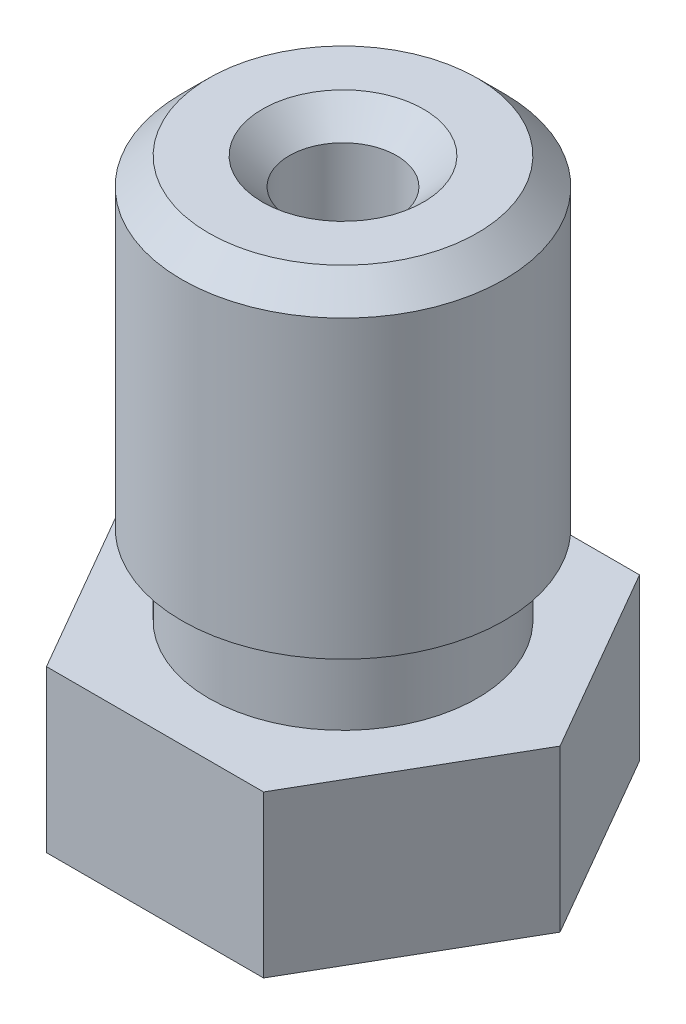
ISO-10303-21;
HEADER;
FILE_DESCRIPTION(('STEP AP214'),'2;1');
FILE_NAME('part.step','',(''),(''),'','','');
FILE_SCHEMA(('AUTOMOTIVE_DESIGN { 1 0 10303 214 1 1 1 1 }'));
ENDSEC;
DATA;
#1=APPLICATION_CONTEXT('core data for automotive mechanical design processes');
#2=APPLICATION_PROTOCOL_DEFINITION('international standard','automotive_design',2000,#1);
#3=PRODUCT_CONTEXT('',#1,'mechanical');
#4=PRODUCT('Part','Part','',(#3));
#5=PRODUCT_RELATED_PRODUCT_CATEGORY('part','',(#4));
#6=PRODUCT_DEFINITION_FORMATION('','',#4);
#7=PRODUCT_DEFINITION_CONTEXT('part definition',#1,'design');
#8=PRODUCT_DEFINITION('design','',#6,#7);
#9=PRODUCT_DEFINITION_SHAPE('','',#8);
#10=(LENGTH_UNIT() NAMED_UNIT(*) SI_UNIT(.MILLI.,.METRE.));
#11=(NAMED_UNIT(*) PLANE_ANGLE_UNIT() SI_UNIT($,.RADIAN.));
#12=(NAMED_UNIT(*) SI_UNIT($,.STERADIAN.) SOLID_ANGLE_UNIT());
#13=UNCERTAINTY_MEASURE_WITH_UNIT(LENGTH_MEASURE(1.E-05),#10,'distance_accuracy_value','');
#14=(GEOMETRIC_REPRESENTATION_CONTEXT(3) GLOBAL_UNCERTAINTY_ASSIGNED_CONTEXT((#13)) GLOBAL_UNIT_ASSIGNED_CONTEXT((#10,
#11,#12)) REPRESENTATION_CONTEXT('',''));
#15=CARTESIAN_POINT('',(0.,0.,0.));
#16=DIRECTION('',(0.,0.,1.));
#17=DIRECTION('',(1.,0.,0.));
#18=AXIS2_PLACEMENT_3D('',#15,#16,#17);
#19=CARTESIAN_POINT('',(0.,3.,0.));
#20=DIRECTION('',(0.,1.,0.));
#21=DIRECTION('',(0.,0.,1.));
#22=AXIS2_PLACEMENT_3D('',#19,#20,#21);
#23=CYLINDRICAL_SURFACE('',#22,0.2);
#24=CARTESIAN_POINT('',(0.,-2.,0.));
#25=DIRECTION('',(0.,1.,0.));
#26=DIRECTION('',(0.,0.,1.));
#27=AXIS2_PLACEMENT_3D('',#24,#25,#26);
#28=CIRCLE('',#27,0.2);
#29=CARTESIAN_POINT('',(0.,-2.,0.2));
#30=VERTEX_POINT('',#29);
#31=EDGE_CURVE('E19',#30,#30,#28,.F.);
#32=ORIENTED_EDGE('',*,*,#31,.T.);
#33=EDGE_LOOP('',(#32));
#34=FACE_BOUND('',#33,.T.);
#35=CARTESIAN_POINT('',(0.,-1.20000000003984,0.));
#36=DIRECTION('',(0.,1.,0.));
#37=DIRECTION('',(0.,0.,1.));
#38=AXIS2_PLACEMENT_3D('',#35,#36,#37);
#39=CIRCLE('',#38,0.200000000006639);
#40=CARTESIAN_POINT('',(0.,-1.20000000003984,0.200000000006639));
#41=VERTEX_POINT('',#40);
#42=EDGE_CURVE('E107',#41,#41,#39,.T.);
#43=ORIENTED_EDGE('',*,*,#42,.T.);
#44=EDGE_LOOP('',(#43));
#45=FACE_BOUND('',#44,.T.);
#46=ADVANCED_FACE('F16',(#34,#45),#23,.F.);
#47=CARTESIAN_POINT('',(0.2,-2.,0.));
#48=DIRECTION('',(0.,1.,0.));
#49=DIRECTION('',(0.,0.,1.));
#50=AXIS2_PLACEMENT_3D('',#47,#48,#49);
#51=PLANE('',#50);
#52=ORIENTED_EDGE('',*,*,#31,.F.);
#53=EDGE_LOOP('',(#52));
#54=FACE_BOUND('',#53,.T.);
#55=CARTESIAN_POINT('',(0.,-2.00000000000955,0.));
#56=DIRECTION('',(0.,1.,0.));
#57=DIRECTION('',(0.,0.,1.));
#58=AXIS2_PLACEMENT_3D('',#55,#56,#57);
#59=CIRCLE('',#58,0.50000000004502);
#60=CARTESIAN_POINT('',(0.,-2.00000000000955,0.50000000004502));
#61=VERTEX_POINT('',#60);
#62=EDGE_CURVE('E106',#61,#61,#59,.T.);
#63=ORIENTED_EDGE('',*,*,#62,.F.);
#64=EDGE_LOOP('',(#63));
#65=FACE_BOUND('',#64,.T.);
#66=ADVANCED_FACE('F132',(#54,#65),#51,.F.);
#67=CARTESIAN_POINT('',(0.,-0.700000000108503,0.));
#68=DIRECTION('',(0.,1.,0.));
#69=DIRECTION('',(0.,0.,1.));
#70=AXIS2_PLACEMENT_3D('',#67,#68,#69);
#71=CONICAL_SURFACE('',#70,0.749999999925421,0.832981266653855);
#72=ORIENTED_EDGE('',*,*,#42,.F.);
#73=EDGE_LOOP('',(#72));
#74=FACE_BOUND('',#73,.T.);
#75=CARTESIAN_POINT('',(0.,-0.700000000000002,0.));
#76=DIRECTION('',(0.,1.,0.));
#77=DIRECTION('',(0.,0.,1.));
#78=AXIS2_PLACEMENT_3D('',#75,#76,#77);
#79=CIRCLE('',#78,0.75);
#80=CARTESIAN_POINT('',(0.,-0.700000000000002,0.75));
#81=VERTEX_POINT('',#80);
#82=EDGE_CURVE('E103',#81,#81,#79,.T.);
#83=ORIENTED_EDGE('',*,*,#82,.T.);
#84=EDGE_LOOP('',(#83));
#85=FACE_BOUND('',#84,.T.);
#86=ADVANCED_FACE('F134',(#74,#85),#71,.F.);
#87=CARTESIAN_POINT('',(0.,-5.6843418860808E-11,0.));
#88=DIRECTION('',(0.,1.,0.));
#89=DIRECTION('',(0.,0.,1.));
#90=AXIS2_PLACEMENT_3D('',#87,#88,#89);
#91=CONICAL_SURFACE('',#90,2.49999999994088,0.785398163383238);
#92=ORIENTED_EDGE('',*,*,#62,.T.);
#93=EDGE_LOOP('',(#92));
#94=FACE_BOUND('',#93,.T.);
#95=CARTESIAN_POINT('',(0.,0.,0.));
#96=DIRECTION('',(0.,1.,0.));
#97=DIRECTION('',(0.,0.,1.));
#98=AXIS2_PLACEMENT_3D('',#95,#96,#97);
#99=CIRCLE('',#98,2.49999999999773);
#100=CARTESIAN_POINT('',(0.,0.,2.49999999999773));
#101=VERTEX_POINT('',#100);
#102=EDGE_CURVE('E102',#101,#101,#99,.F.);
#103=ORIENTED_EDGE('',*,*,#102,.T.);
#104=EDGE_LOOP('',(#103));
#105=FACE_BOUND('',#104,.T.);
#106=ADVANCED_FACE('F129',(#94,#105),#91,.T.);
#107=CARTESIAN_POINT('',(0.,3.,0.));
#108=DIRECTION('',(0.,1.,0.));
#109=DIRECTION('',(0.,0.,1.));
#110=AXIS2_PLACEMENT_3D('',#107,#108,#109);
#111=CYLINDRICAL_SURFACE('',#110,0.75);
#112=ORIENTED_EDGE('',*,*,#82,.F.);
#113=EDGE_LOOP('',(#112));
#114=FACE_BOUND('',#113,.T.);
#115=CARTESIAN_POINT('',(0.,-0.227272727272521,0.));
#116=DIRECTION('',(0.,1.,0.));
#117=DIRECTION('',(0.,0.,1.));
#118=AXIS2_PLACEMENT_3D('',#115,#116,#117);
#119=CIRCLE('',#118,0.749999999982265);
#120=CARTESIAN_POINT('',(0.,-0.227272727272521,0.749999999982265));
#121=VERTEX_POINT('',#120);
#122=EDGE_CURVE('E80',#121,#121,#119,.T.);
#123=ORIENTED_EDGE('',*,*,#122,.T.);
#124=EDGE_LOOP('',(#123));
#125=FACE_BOUND('',#124,.T.);
#126=ADVANCED_FACE('F206',(#114,#125),#111,.F.);
#127=CARTESIAN_POINT('',(0.,0.,0.));
#128=DIRECTION('',(0.,1.,0.));
#129=DIRECTION('',(0.,0.,1.));
#130=AXIS2_PLACEMENT_3D('',#127,#128,#129);
#131=PLANE('',#130);
#132=ORIENTED_EDGE('',*,*,#102,.F.);
#133=EDGE_LOOP('',(#132));
#134=FACE_BOUND('',#133,.T.);
#135=DIRECTION('',(-0.5,0.,-0.866025403784439));
#136=VECTOR('',#135,1.);
#137=CARTESIAN_POINT('',(-4.04145188432738,0.,0.));
#138=LINE('',#137,#136);
#139=CARTESIAN_POINT('',(-2.02072594216369,0.,3.5));
#140=VERTEX_POINT('',#139);
#141=CARTESIAN_POINT('',(-4.04145188432738,0.,0.));
#142=VERTEX_POINT('',#141);
#143=EDGE_CURVE('E99',#140,#142,#138,.T.);
#144=ORIENTED_EDGE('',*,*,#143,.T.);
#145=DIRECTION('',(0.5,0.,-0.866025403784439));
#146=VECTOR('',#145,1.);
#147=CARTESIAN_POINT('',(-2.02072594216369,0.,-3.5));
#148=LINE('',#147,#146);
#149=CARTESIAN_POINT('',(-2.02072594216369,0.,-3.5));
#150=VERTEX_POINT('',#149);
#151=EDGE_CURVE('E381',#142,#150,#148,.T.);
#152=ORIENTED_EDGE('',*,*,#151,.T.);
#153=DIRECTION('',(1.,0.,0.));
#154=VECTOR('',#153,1.);
#155=CARTESIAN_POINT('',(2.02072594216369,0.,-3.5));
#156=LINE('',#155,#154);
#157=CARTESIAN_POINT('',(2.02072594216369,0.,-3.5));
#158=VERTEX_POINT('',#157);
#159=EDGE_CURVE('E360',#150,#158,#156,.T.);
#160=ORIENTED_EDGE('',*,*,#159,.T.);
#161=DIRECTION('',(0.500000000000001,0.,0.866025403784438));
#162=VECTOR('',#161,1.);
#163=CARTESIAN_POINT('',(4.04145188432738,0.,0.));
#164=LINE('',#163,#162);
#165=CARTESIAN_POINT('',(4.04145188432738,0.,0.));
#166=VERTEX_POINT('',#165);
#167=EDGE_CURVE('E84',#158,#166,#164,.T.);
#168=ORIENTED_EDGE('',*,*,#167,.T.);
#169=DIRECTION('',(-0.5,0.,0.866025403784439));
#170=VECTOR('',#169,1.);
#171=CARTESIAN_POINT('',(2.02072594216369,0.,3.5));
#172=LINE('',#171,#170);
#173=CARTESIAN_POINT('',(2.02072594216369,0.,3.5));
#174=VERTEX_POINT('',#173);
#175=EDGE_CURVE('E66',#166,#174,#172,.T.);
#176=ORIENTED_EDGE('',*,*,#175,.T.);
#177=DIRECTION('',(-1.,0.,0.));
#178=VECTOR('',#177,1.);
#179=CARTESIAN_POINT('',(-2.02072594216369,0.,3.5));
#180=LINE('',#179,#178);
#181=EDGE_CURVE('E71',#174,#140,#180,.T.);
#182=ORIENTED_EDGE('',*,*,#181,.T.);
#183=EDGE_LOOP('',(#144,#152,#160,#168,#176,#182));
#184=FACE_BOUND('',#183,.T.);
#185=ADVANCED_FACE('F82',(#134,#184),#131,.F.);
#186=CARTESIAN_POINT('',(0.,-1.13686837721616E-10,0.));
#187=DIRECTION('',(0.,1.,0.));
#188=DIRECTION('',(0.,0.,1.));
#189=AXIS2_PLACEMENT_3D('',#186,#187,#188);
#190=CONICAL_SURFACE('',#189,0.999999999862666,0.832981266776287);
#191=ORIENTED_EDGE('',*,*,#122,.F.);
#192=EDGE_LOOP('',(#191));
#193=FACE_BOUND('',#192,.T.);
#194=CARTESIAN_POINT('',(0.,0.,0.));
#195=DIRECTION('',(0.,-1.,0.));
#196=DIRECTION('',(0.,0.,-1.));
#197=AXIS2_PLACEMENT_3D('',#194,#195,#196);
#198=CIRCLE('',#197,1.);
#199=CARTESIAN_POINT('',(0.,0.,-1.));
#200=VERTEX_POINT('',#199);
#201=EDGE_CURVE('E95',#200,#200,#198,.F.);
#202=ORIENTED_EDGE('',*,*,#201,.T.);
#203=EDGE_LOOP('',(#202));
#204=FACE_BOUND('',#203,.T.);
#205=ADVANCED_FACE('F200',(#193,#204),#190,.F.);
#206=CARTESIAN_POINT('',(-2.02072594216369,3.,3.5));
#207=DIRECTION('',(0.,0.,-1.));
#208=DIRECTION('',(-1.,0.,0.));
#209=AXIS2_PLACEMENT_3D('',#206,#207,#208);
#210=PLANE('',#209);
#211=DIRECTION('',(0.,1.,0.));
#212=VECTOR('',#211,1.);
#213=CARTESIAN_POINT('',(2.02072594216369,3.,3.5));
#214=LINE('',#213,#212);
#215=CARTESIAN_POINT('',(2.02072594216369,3.,3.5));
#216=VERTEX_POINT('',#215);
#217=EDGE_CURVE('E73',#174,#216,#214,.T.);
#218=ORIENTED_EDGE('',*,*,#217,.T.);
#219=DIRECTION('',(1.,0.,0.));
#220=VECTOR('',#219,1.);
#221=CARTESIAN_POINT('',(0.,3.,3.5));
#222=LINE('',#221,#220);
#223=CARTESIAN_POINT('',(-2.02072594216369,3.,3.5));
#224=VERTEX_POINT('',#223);
#225=EDGE_CURVE('E98',#224,#216,#222,.T.);
#226=ORIENTED_EDGE('',*,*,#225,.F.);
#227=DIRECTION('',(0.,1.,0.));
#228=VECTOR('',#227,1.);
#229=CARTESIAN_POINT('',(-2.02072594216369,3.,3.5));
#230=LINE('',#229,#228);
#231=EDGE_CURVE('E76',#224,#140,#230,.F.);
#232=ORIENTED_EDGE('',*,*,#231,.T.);
#233=ORIENTED_EDGE('',*,*,#181,.F.);
#234=EDGE_LOOP('',(#218,#226,#232,#233));
#235=FACE_BOUND('',#234,.T.);
#236=ADVANCED_FACE('F72',(#235),#210,.F.);
#237=CARTESIAN_POINT('',(2.02072594216369,3.,3.5));
#238=DIRECTION('',(-0.866025403784439,0.,-0.5));
#239=DIRECTION('',(-0.5,0.,0.866025403784439));
#240=AXIS2_PLACEMENT_3D('',#237,#238,#239);
#241=PLANE('',#240);
#242=DIRECTION('',(0.,1.,0.));
#243=VECTOR('',#242,1.);
#244=CARTESIAN_POINT('',(4.04145188432738,3.,0.));
#245=LINE('',#244,#243);
#246=CARTESIAN_POINT('',(4.04145188432738,3.,0.));
#247=VERTEX_POINT('',#246);
#248=EDGE_CURVE('E86',#166,#247,#245,.T.);
#249=ORIENTED_EDGE('',*,*,#248,.T.);
#250=DIRECTION('',(0.5,0.,-0.866025403784439));
#251=VECTOR('',#250,1.);
#252=CARTESIAN_POINT('',(2.02072594216369,3.,3.5));
#253=LINE('',#252,#251);
#254=EDGE_CURVE('E90',#216,#247,#253,.T.);
#255=ORIENTED_EDGE('',*,*,#254,.F.);
#256=ORIENTED_EDGE('',*,*,#217,.F.);
#257=ORIENTED_EDGE('',*,*,#175,.F.);
#258=EDGE_LOOP('',(#249,#255,#256,#257));
#259=FACE_BOUND('',#258,.T.);
#260=ADVANCED_FACE('F88',(#259),#241,.F.);
#261=CARTESIAN_POINT('',(4.04145188432738,3.,0.));
#262=DIRECTION('',(-0.866025403784438,0.,0.500000000000001));
#263=DIRECTION('',(0.500000000000001,0.,0.866025403784438));
#264=AXIS2_PLACEMENT_3D('',#261,#262,#263);
#265=PLANE('',#264);
#266=DIRECTION('',(0.,1.,0.));
#267=VECTOR('',#266,1.);
#268=CARTESIAN_POINT('',(2.02072594216369,3.,-3.5));
#269=LINE('',#268,#267);
#270=CARTESIAN_POINT('',(2.02072594216369,3.,-3.5));
#271=VERTEX_POINT('',#270);
#272=EDGE_CURVE('E356',#158,#271,#269,.T.);
#273=ORIENTED_EDGE('',*,*,#272,.T.);
#274=DIRECTION('',(-0.500000000000001,0.,-0.866025403784438));
#275=VECTOR('',#274,1.);
#276=CARTESIAN_POINT('',(4.04145188432738,3.,0.));
#277=LINE('',#276,#275);
#278=EDGE_CURVE('E359',#247,#271,#277,.T.);
#279=ORIENTED_EDGE('',*,*,#278,.F.);
#280=ORIENTED_EDGE('',*,*,#248,.F.);
#281=ORIENTED_EDGE('',*,*,#167,.F.);
#282=EDGE_LOOP('',(#273,#279,#280,#281));
#283=FACE_BOUND('',#282,.T.);
#284=ADVANCED_FACE('F191',(#283),#265,.F.);
#285=CARTESIAN_POINT('',(2.02072594216369,3.,-3.5));
#286=DIRECTION('',(0.,0.,1.));
#287=DIRECTION('',(1.,0.,0.));
#288=AXIS2_PLACEMENT_3D('',#285,#286,#287);
#289=PLANE('',#288);
#290=DIRECTION('',(0.,1.,0.));
#291=VECTOR('',#290,1.);
#292=CARTESIAN_POINT('',(-2.02072594216369,3.,-3.5));
#293=LINE('',#292,#291);
#294=CARTESIAN_POINT('',(-2.02072594216369,3.,-3.5));
#295=VERTEX_POINT('',#294);
#296=EDGE_CURVE('E365',#150,#295,#293,.T.);
#297=ORIENTED_EDGE('',*,*,#296,.T.);
#298=DIRECTION('',(1.,0.,0.));
#299=VECTOR('',#298,1.);
#300=CARTESIAN_POINT('',(0.,3.,-3.5));
#301=LINE('',#300,#299);
#302=EDGE_CURVE('E363',#271,#295,#301,.F.);
#303=ORIENTED_EDGE('',*,*,#302,.F.);
#304=ORIENTED_EDGE('',*,*,#272,.F.);
#305=ORIENTED_EDGE('',*,*,#159,.F.);
#306=EDGE_LOOP('',(#297,#303,#304,#305));
#307=FACE_BOUND('',#306,.T.);
#308=ADVANCED_FACE('F188',(#307),#289,.F.);
#309=CARTESIAN_POINT('',(-2.02072594216369,3.,-3.5));
#310=DIRECTION('',(0.866025403784439,0.,0.5));
#311=DIRECTION('',(0.5,0.,-0.866025403784439));
#312=AXIS2_PLACEMENT_3D('',#309,#310,#311);
#313=PLANE('',#312);
#314=DIRECTION('',(0.,1.,0.));
#315=VECTOR('',#314,1.);
#316=CARTESIAN_POINT('',(-4.04145188432738,3.,0.));
#317=LINE('',#316,#315);
#318=CARTESIAN_POINT('',(-4.04145188432738,3.,0.));
#319=VERTEX_POINT('',#318);
#320=EDGE_CURVE('E34',#142,#319,#317,.T.);
#321=ORIENTED_EDGE('',*,*,#320,.T.);
#322=DIRECTION('',(-0.5,0.,0.866025403784439));
#323=VECTOR('',#322,1.);
#324=CARTESIAN_POINT('',(-2.02072594216369,3.,-3.5));
#325=LINE('',#324,#323);
#326=EDGE_CURVE('E368',#295,#319,#325,.T.);
#327=ORIENTED_EDGE('',*,*,#326,.F.);
#328=ORIENTED_EDGE('',*,*,#296,.F.);
#329=ORIENTED_EDGE('',*,*,#151,.F.);
#330=EDGE_LOOP('',(#321,#327,#328,#329));
#331=FACE_BOUND('',#330,.T.);
#332=ADVANCED_FACE('F184',(#331),#313,.F.);
#333=CARTESIAN_POINT('',(-4.04145188432738,3.,0.));
#334=DIRECTION('',(0.866025403784439,0.,-0.5));
#335=DIRECTION('',(-0.5,0.,-0.866025403784439));
#336=AXIS2_PLACEMENT_3D('',#333,#334,#335);
#337=PLANE('',#336);
#338=ORIENTED_EDGE('',*,*,#231,.F.);
#339=DIRECTION('',(0.5,0.,0.866025403784438));
#340=VECTOR('',#339,1.);
#341=CARTESIAN_POINT('',(-4.04145188432738,3.,0.));
#342=LINE('',#341,#340);
#343=EDGE_CURVE('E377',#319,#224,#342,.T.);
#344=ORIENTED_EDGE('',*,*,#343,.F.);
#345=ORIENTED_EDGE('',*,*,#320,.F.);
#346=ORIENTED_EDGE('',*,*,#143,.F.);
#347=EDGE_LOOP('',(#338,#344,#345,#346));
#348=FACE_BOUND('',#347,.T.);
#349=ADVANCED_FACE('F180',(#348),#337,.F.);
#350=CARTESIAN_POINT('',(0.,3.,0.));
#351=DIRECTION('',(0.,-1.,0.));
#352=DIRECTION('',(0.,0.,-1.));
#353=AXIS2_PLACEMENT_3D('',#350,#351,#352);
#354=CYLINDRICAL_SURFACE('',#353,1.);
#355=CARTESIAN_POINT('',(0.,9.99999999993406,0.));
#356=DIRECTION('',(0.,1.,0.));
#357=DIRECTION('',(0.,0.,1.));
#358=AXIS2_PLACEMENT_3D('',#355,#356,#357);
#359=CIRCLE('',#358,1.0000000000332);
#360=CARTESIAN_POINT('',(0.,9.99999999993406,1.0000000000332));
#361=VERTEX_POINT('',#360);
#362=EDGE_CURVE('E124',#361,#361,#359,.T.);
#363=ORIENTED_EDGE('',*,*,#362,.T.);
#364=EDGE_LOOP('',(#363));
#365=FACE_BOUND('',#364,.T.);
#366=ORIENTED_EDGE('',*,*,#201,.F.);
#367=EDGE_LOOP('',(#366));
#368=FACE_BOUND('',#367,.T.);
#369=ADVANCED_FACE('F176',(#365,#368),#354,.F.);
#370=CARTESIAN_POINT('',(0.,3.,0.));
#371=DIRECTION('',(0.,1.,0.));
#372=DIRECTION('',(0.,0.,1.));
#373=AXIS2_PLACEMENT_3D('',#370,#371,#372);
#374=PLANE('',#373);
#375=CARTESIAN_POINT('',(0.,3.,0.));
#376=DIRECTION('',(0.,1.,0.));
#377=DIRECTION('',(0.,0.,1.));
#378=AXIS2_PLACEMENT_3D('',#375,#376,#377);
#379=CIRCLE('',#378,2.5);
#380=CARTESIAN_POINT('',(0.,3.,2.5));
#381=VERTEX_POINT('',#380);
#382=EDGE_CURVE('E121',#381,#381,#379,.T.);
#383=ORIENTED_EDGE('',*,*,#382,.F.);
#384=EDGE_LOOP('',(#383));
#385=FACE_BOUND('',#384,.T.);
#386=ORIENTED_EDGE('',*,*,#326,.T.);
#387=ORIENTED_EDGE('',*,*,#343,.T.);
#388=ORIENTED_EDGE('',*,*,#225,.T.);
#389=ORIENTED_EDGE('',*,*,#254,.T.);
#390=ORIENTED_EDGE('',*,*,#278,.T.);
#391=ORIENTED_EDGE('',*,*,#302,.T.);
#392=EDGE_LOOP('',(#386,#387,#388,#389,#390,#391));
#393=FACE_BOUND('',#392,.T.);
#394=ADVANCED_FACE('F172',(#385,#393),#374,.T.);
#395=CARTESIAN_POINT('',(0.,10.4999999998086,0.));
#396=DIRECTION('',(0.,1.,0.));
#397=DIRECTION('',(0.,0.,1.));
#398=AXIS2_PLACEMENT_3D('',#395,#396,#397);
#399=CONICAL_SURFACE('',#398,1.49999999985084,0.785398163397448);
#400=ORIENTED_EDGE('',*,*,#362,.F.);
#401=EDGE_LOOP('',(#400));
#402=FACE_BOUND('',#401,.T.);
#403=CARTESIAN_POINT('',(0.,10.4999999999791,0.));
#404=DIRECTION('',(0.,1.,0.));
#405=DIRECTION('',(0.,0.,1.));
#406=AXIS2_PLACEMENT_3D('',#403,#404,#405);
#407=CIRCLE('',#406,1.50000000002137);
#408=CARTESIAN_POINT('',(0.,10.4999999999791,1.50000000002137));
#409=VERTEX_POINT('',#408);
#410=EDGE_CURVE('E118',#409,#409,#407,.T.);
#411=ORIENTED_EDGE('',*,*,#410,.T.);
#412=EDGE_LOOP('',(#411));
#413=FACE_BOUND('',#412,.T.);
#414=ADVANCED_FACE('F168',(#402,#413),#399,.F.);
#415=CARTESIAN_POINT('',(0.,3.,0.));
#416=DIRECTION('',(0.,1.,0.));
#417=DIRECTION('',(0.,0.,1.));
#418=AXIS2_PLACEMENT_3D('',#415,#416,#417);
#419=CYLINDRICAL_SURFACE('',#418,2.5);
#420=CARTESIAN_POINT('',(0.,4.5,0.));
#421=DIRECTION('',(0.,1.,0.));
#422=DIRECTION('',(0.,0.,1.));
#423=AXIS2_PLACEMENT_3D('',#420,#421,#422);
#424=CIRCLE('',#423,2.5);
#425=CARTESIAN_POINT('',(0.,4.5,2.5));
#426=VERTEX_POINT('',#425);
#427=EDGE_CURVE('E115',#426,#426,#424,.F.);
#428=ORIENTED_EDGE('',*,*,#427,.T.);
#429=EDGE_LOOP('',(#428));
#430=FACE_BOUND('',#429,.T.);
#431=ORIENTED_EDGE('',*,*,#382,.T.);
#432=EDGE_LOOP('',(#431));
#433=FACE_BOUND('',#432,.T.);
#434=ADVANCED_FACE('F164',(#430,#433),#419,.T.);
#435=CARTESIAN_POINT('',(1.5,10.5,0.));
#436=DIRECTION('',(0.,-1.,0.));
#437=DIRECTION('',(0.,0.,-1.));
#438=AXIS2_PLACEMENT_3D('',#435,#436,#437);
#439=PLANE('',#438);
#440=ORIENTED_EDGE('',*,*,#410,.F.);
#441=EDGE_LOOP('',(#440));
#442=FACE_BOUND('',#441,.T.);
#443=CARTESIAN_POINT('',(0.,10.4999999999791,0.));
#444=DIRECTION('',(0.,-1.,0.));
#445=DIRECTION('',(0.,0.,-1.));
#446=AXIS2_PLACEMENT_3D('',#443,#444,#445);
#447=CIRCLE('',#446,2.49999999999773);
#448=CARTESIAN_POINT('',(0.,10.4999999999791,-2.49999999999773));
#449=VERTEX_POINT('',#448);
#450=EDGE_CURVE('E112',#449,#449,#447,.T.);
#451=ORIENTED_EDGE('',*,*,#450,.F.);
#452=EDGE_LOOP('',(#451));
#453=FACE_BOUND('',#452,.T.);
#454=ADVANCED_FACE('F160',(#442,#453),#439,.F.);
#455=CARTESIAN_POINT('',(3.,4.5,0.));
#456=DIRECTION('',(0.,1.,0.));
#457=DIRECTION('',(0.,0.,1.));
#458=AXIS2_PLACEMENT_3D('',#455,#456,#457);
#459=PLANE('',#458);
#460=ORIENTED_EDGE('',*,*,#427,.F.);
#461=EDGE_LOOP('',(#460));
#462=FACE_BOUND('',#461,.T.);
#463=CARTESIAN_POINT('',(0.,4.5,0.));
#464=DIRECTION('',(0.,1.,0.));
#465=DIRECTION('',(0.,0.,1.));
#466=AXIS2_PLACEMENT_3D('',#463,#464,#465);
#467=CIRCLE('',#466,3.);
#468=CARTESIAN_POINT('',(0.,4.5,3.));
#469=VERTEX_POINT('',#468);
#470=EDGE_CURVE('E25',#469,#469,#467,.T.);
#471=ORIENTED_EDGE('',*,*,#470,.F.);
#472=EDGE_LOOP('',(#471));
#473=FACE_BOUND('',#472,.T.);
#474=ADVANCED_FACE('F153',(#462,#473),#459,.F.);
#475=CARTESIAN_POINT('',(0.,10.0000000000477,0.));
#476=DIRECTION('',(0.,-1.,0.));
#477=DIRECTION('',(0.,0.,-1.));
#478=AXIS2_PLACEMENT_3D('',#475,#476,#477);
#479=CONICAL_SURFACE('',#478,2.99999999987222,0.785398163340605);
#480=CARTESIAN_POINT('',(0.,10.,0.));
#481=DIRECTION('',(0.,1.,0.));
#482=DIRECTION('',(0.,0.,1.));
#483=AXIS2_PLACEMENT_3D('',#480,#481,#482);
#484=CIRCLE('',#483,3.);
#485=CARTESIAN_POINT('',(0.,10.,3.));
#486=VERTEX_POINT('',#485);
#487=EDGE_CURVE('E11',#486,#486,#484,.F.);
#488=ORIENTED_EDGE('',*,*,#487,.F.);
#489=EDGE_LOOP('',(#488));
#490=FACE_BOUND('',#489,.T.);
#491=ORIENTED_EDGE('',*,*,#450,.T.);
#492=EDGE_LOOP('',(#491));
#493=FACE_BOUND('',#492,.T.);
#494=ADVANCED_FACE('F147',(#490,#493),#479,.T.);
#495=CARTESIAN_POINT('',(0.,3.,0.));
#496=DIRECTION('',(0.,1.,0.));
#497=DIRECTION('',(0.,0.,1.));
#498=AXIS2_PLACEMENT_3D('',#495,#496,#497);
#499=CYLINDRICAL_SURFACE('',#498,3.);
#500=ORIENTED_EDGE('',*,*,#487,.T.);
#501=EDGE_LOOP('',(#500));
#502=FACE_BOUND('',#501,.T.);
#503=ORIENTED_EDGE('',*,*,#470,.T.);
#504=EDGE_LOOP('',(#503));
#505=FACE_BOUND('',#504,.T.);
#506=ADVANCED_FACE('F145',(#502,#505),#499,.T.);
#507=CLOSED_SHELL('',(#46,#66,#86,#106,#126,#185,#205,#236,#260,#284,#308,#332,#349,#369,#394,
#414,#434,#454,#474,#494,#506));
#508=MANIFOLD_SOLID_BREP('B1',#507);
#509=ADVANCED_BREP_SHAPE_REPRESENTATION('',(#18,#508),#14);
#510=SHAPE_DEFINITION_REPRESENTATION(#9,#509);
ENDSEC;
END-ISO-10303-21;
